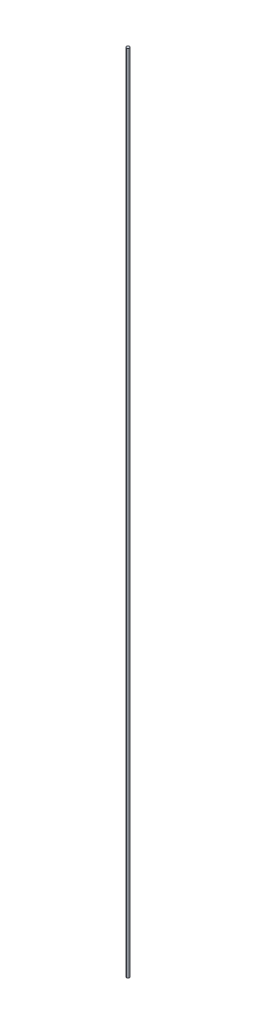
ISO-10303-21;
HEADER;
FILE_DESCRIPTION(('STEP AP214'),'2;1');
FILE_NAME('part.step','',(''),(''),'','','');
FILE_SCHEMA(('AUTOMOTIVE_DESIGN { 1 0 10303 214 1 1 1 1 }'));
ENDSEC;
DATA;
#1=APPLICATION_CONTEXT('core data for automotive mechanical design processes');
#2=APPLICATION_PROTOCOL_DEFINITION('international standard','automotive_design',2000,#1);
#3=PRODUCT_CONTEXT('',#1,'mechanical');
#4=PRODUCT('Part','Part','',(#3));
#5=PRODUCT_RELATED_PRODUCT_CATEGORY('part','',(#4));
#6=PRODUCT_DEFINITION_FORMATION('','',#4);
#7=PRODUCT_DEFINITION_CONTEXT('part definition',#1,'design');
#8=PRODUCT_DEFINITION('design','',#6,#7);
#9=PRODUCT_DEFINITION_SHAPE('','',#8);
#10=(LENGTH_UNIT() NAMED_UNIT(*) SI_UNIT(.MILLI.,.METRE.));
#11=(NAMED_UNIT(*) PLANE_ANGLE_UNIT() SI_UNIT($,.RADIAN.));
#12=(NAMED_UNIT(*) SI_UNIT($,.STERADIAN.) SOLID_ANGLE_UNIT());
#13=UNCERTAINTY_MEASURE_WITH_UNIT(LENGTH_MEASURE(1.E-05),#10,'distance_accuracy_value','');
#14=(GEOMETRIC_REPRESENTATION_CONTEXT(3) GLOBAL_UNCERTAINTY_ASSIGNED_CONTEXT((#13)) GLOBAL_UNIT_ASSIGNED_CONTEXT((#10,
#11,#12)) REPRESENTATION_CONTEXT('',''));
#15=CARTESIAN_POINT('',(0.,0.,0.));
#16=DIRECTION('',(0.,0.,1.));
#17=DIRECTION('',(1.,0.,0.));
#18=AXIS2_PLACEMENT_3D('',#15,#16,#17);
#19=CARTESIAN_POINT('',(0.,0.,0.));
#20=DIRECTION('',(0.,1.,0.));
#21=DIRECTION('',(1.,0.,0.));
#22=AXIS2_PLACEMENT_3D('',#19,#20,#21);
#23=PLANE('',#22);
#24=CARTESIAN_POINT('',(0.,0.,0.));
#25=DIRECTION('',(0.,1.,0.));
#26=DIRECTION('',(0.,0.,1.));
#27=AXIS2_PLACEMENT_3D('',#24,#25,#26);
#28=CIRCLE('',#27,0.508);
#29=CARTESIAN_POINT('',(0.,0.,-0.508));
#30=VERTEX_POINT('',#29);
#31=CARTESIAN_POINT('',(0.,0.,0.508));
#32=VERTEX_POINT('',#31);
#33=EDGE_CURVE('E11',#30,#32,#28,.T.);
#34=ORIENTED_EDGE('',*,*,#33,.F.);
#35=CARTESIAN_POINT('',(0.,0.,0.));
#36=DIRECTION('',(0.,1.,0.));
#37=DIRECTION('',(0.,0.,1.));
#38=AXIS2_PLACEMENT_3D('',#35,#36,#37);
#39=CIRCLE('',#38,0.508);
#40=EDGE_CURVE('E63',#32,#30,#39,.T.);
#41=ORIENTED_EDGE('',*,*,#40,.F.);
#42=EDGE_LOOP('',(#34,#41));
#43=FACE_BOUND('',#42,.T.);
#44=ADVANCED_FACE('F17',(#43),#23,.F.);
#45=CARTESIAN_POINT('',(0.,285.14,0.));
#46=DIRECTION('',(0.,1.,0.));
#47=DIRECTION('',(1.,0.,0.));
#48=AXIS2_PLACEMENT_3D('',#45,#46,#47);
#49=PLANE('',#48);
#50=CARTESIAN_POINT('',(0.,285.14,0.));
#51=DIRECTION('',(0.,1.,0.));
#52=DIRECTION('',(0.,0.,1.));
#53=AXIS2_PLACEMENT_3D('',#50,#51,#52);
#54=CIRCLE('',#53,0.508);
#55=CARTESIAN_POINT('',(0.,285.14,-0.508));
#56=VERTEX_POINT('',#55);
#57=CARTESIAN_POINT('',(0.,285.14,0.508));
#58=VERTEX_POINT('',#57);
#59=EDGE_CURVE('E20',#56,#58,#54,.T.);
#60=ORIENTED_EDGE('',*,*,#59,.T.);
#61=CARTESIAN_POINT('',(0.,285.14,0.));
#62=DIRECTION('',(0.,1.,0.));
#63=DIRECTION('',(0.,0.,1.));
#64=AXIS2_PLACEMENT_3D('',#61,#62,#63);
#65=CIRCLE('',#64,0.508);
#66=EDGE_CURVE('E62',#58,#56,#65,.T.);
#67=ORIENTED_EDGE('',*,*,#66,.T.);
#68=EDGE_LOOP('',(#60,#67));
#69=FACE_BOUND('',#68,.T.);
#70=ADVANCED_FACE('F65',(#69),#49,.T.);
#71=CARTESIAN_POINT('',(0.,285.14,0.));
#72=DIRECTION('',(0.,-1.,0.));
#73=DIRECTION('',(0.,0.,-1.));
#74=AXIS2_PLACEMENT_3D('',#71,#72,#73);
#75=CYLINDRICAL_SURFACE('',#74,0.508);
#76=DIRECTION('',(0.,-1.,0.));
#77=VECTOR('',#76,1.);
#78=CARTESIAN_POINT('',(0.,285.14,0.508));
#79=LINE('',#78,#77);
#80=EDGE_CURVE('E55',#58,#32,#79,.T.);
#81=ORIENTED_EDGE('',*,*,#80,.F.);
#82=ORIENTED_EDGE('',*,*,#59,.F.);
#83=DIRECTION('',(0.,-1.,0.));
#84=VECTOR('',#83,1.);
#85=CARTESIAN_POINT('',(0.,285.14,-0.508));
#86=LINE('',#85,#84);
#87=EDGE_CURVE('E52',#56,#30,#86,.T.);
#88=ORIENTED_EDGE('',*,*,#87,.T.);
#89=ORIENTED_EDGE('',*,*,#33,.T.);
#90=EDGE_LOOP('',(#81,#82,#88,#89));
#91=FACE_BOUND('',#90,.T.);
#92=ADVANCED_FACE('F51',(#91),#75,.T.);
#93=CARTESIAN_POINT('',(0.,285.14,0.));
#94=DIRECTION('',(0.,-1.,0.));
#95=DIRECTION('',(0.,0.,-1.));
#96=AXIS2_PLACEMENT_3D('',#93,#94,#95);
#97=CYLINDRICAL_SURFACE('',#96,0.508);
#98=ORIENTED_EDGE('',*,*,#66,.F.);
#99=ORIENTED_EDGE('',*,*,#80,.T.);
#100=ORIENTED_EDGE('',*,*,#40,.T.);
#101=ORIENTED_EDGE('',*,*,#87,.F.);
#102=EDGE_LOOP('',(#98,#99,#100,#101));
#103=FACE_BOUND('',#102,.T.);
#104=ADVANCED_FACE('F61',(#103),#97,.T.);
#105=CLOSED_SHELL('',(#44,#70,#92,#104));
#106=MANIFOLD_SOLID_BREP('B1',#105);
#107=ADVANCED_BREP_SHAPE_REPRESENTATION('',(#18,#106),#14);
#108=SHAPE_DEFINITION_REPRESENTATION(#9,#107);
ENDSEC;
END-ISO-10303-21;
